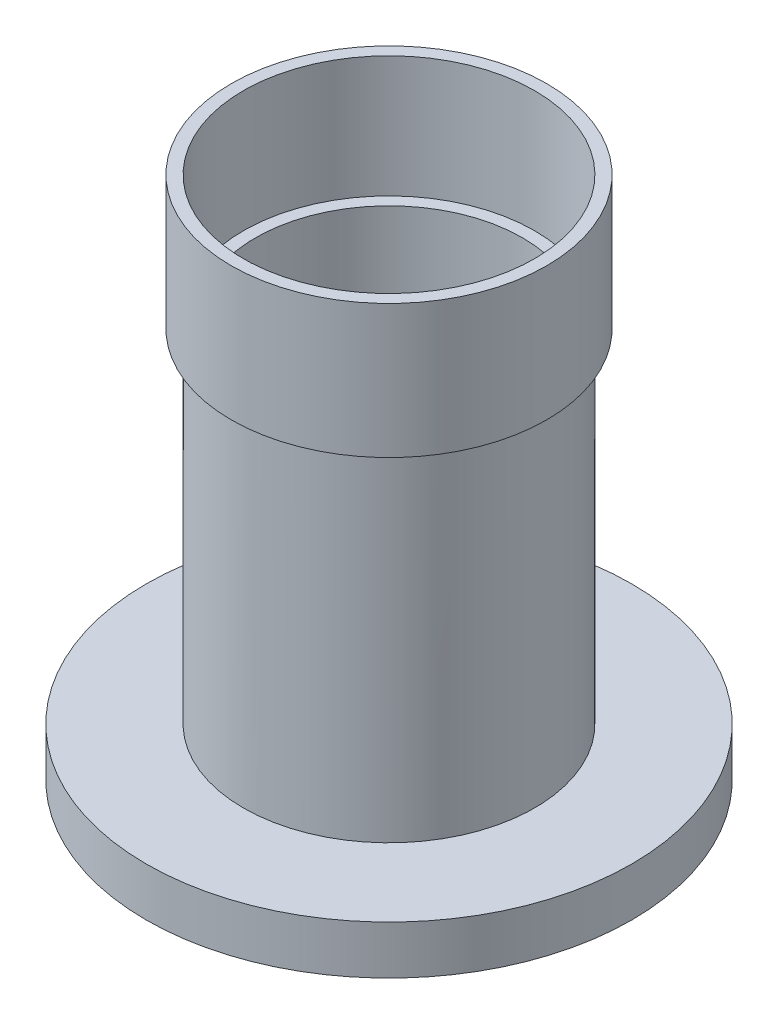
ISO-10303-21;
HEADER;
FILE_DESCRIPTION(('STEP AP214'),'2;1');
FILE_NAME('part.step','',(''),(''),'','','');
FILE_SCHEMA(('AUTOMOTIVE_DESIGN { 1 0 10303 214 1 1 1 1 }'));
ENDSEC;
DATA;
#1=APPLICATION_CONTEXT('core data for automotive mechanical design processes');
#2=APPLICATION_PROTOCOL_DEFINITION('international standard','automotive_design',2000,#1);
#3=PRODUCT_CONTEXT('',#1,'mechanical');
#4=PRODUCT('Part','Part','',(#3));
#5=PRODUCT_RELATED_PRODUCT_CATEGORY('part','',(#4));
#6=PRODUCT_DEFINITION_FORMATION('','',#4);
#7=PRODUCT_DEFINITION_CONTEXT('part definition',#1,'design');
#8=PRODUCT_DEFINITION('design','',#6,#7);
#9=PRODUCT_DEFINITION_SHAPE('','',#8);
#10=(LENGTH_UNIT() NAMED_UNIT(*) SI_UNIT(.MILLI.,.METRE.));
#11=(NAMED_UNIT(*) PLANE_ANGLE_UNIT() SI_UNIT($,.RADIAN.));
#12=(NAMED_UNIT(*) SI_UNIT($,.STERADIAN.) SOLID_ANGLE_UNIT());
#13=UNCERTAINTY_MEASURE_WITH_UNIT(LENGTH_MEASURE(1.E-05),#10,'distance_accuracy_value','');
#14=(GEOMETRIC_REPRESENTATION_CONTEXT(3) GLOBAL_UNCERTAINTY_ASSIGNED_CONTEXT((#13)) GLOBAL_UNIT_ASSIGNED_CONTEXT((#10,
#11,#12)) REPRESENTATION_CONTEXT('',''));
#15=CARTESIAN_POINT('',(0.,0.,0.));
#16=DIRECTION('',(0.,0.,1.));
#17=DIRECTION('',(1.,0.,0.));
#18=AXIS2_PLACEMENT_3D('',#15,#16,#17);
#19=CARTESIAN_POINT('',(0.,6.35,0.));
#20=DIRECTION('',(0.,-1.,0.));
#21=DIRECTION('',(0.,0.,-1.));
#22=AXIS2_PLACEMENT_3D('',#19,#20,#21);
#23=CYLINDRICAL_SURFACE('',#22,31.75);
#24=CARTESIAN_POINT('',(0.,6.35,0.));
#25=DIRECTION('',(0.,1.,0.));
#26=DIRECTION('',(0.,0.,1.));
#27=AXIS2_PLACEMENT_3D('',#24,#25,#26);
#28=CIRCLE('',#27,31.75);
#29=CARTESIAN_POINT('',(0.,6.35,31.75));
#30=VERTEX_POINT('',#29);
#31=EDGE_CURVE('E49',#30,#30,#28,.T.);
#32=ORIENTED_EDGE('',*,*,#31,.F.);
#33=EDGE_LOOP('',(#32));
#34=FACE_BOUND('',#33,.T.);
#35=CARTESIAN_POINT('',(0.,0.,0.));
#36=DIRECTION('',(0.,1.,0.));
#37=DIRECTION('',(0.,0.,1.));
#38=AXIS2_PLACEMENT_3D('',#35,#36,#37);
#39=CIRCLE('',#38,31.75);
#40=CARTESIAN_POINT('',(0.,0.,31.75));
#41=VERTEX_POINT('',#40);
#42=EDGE_CURVE('E54',#41,#41,#39,.T.);
#43=ORIENTED_EDGE('',*,*,#42,.T.);
#44=EDGE_LOOP('',(#43));
#45=FACE_BOUND('',#44,.T.);
#46=ADVANCED_FACE('F37',(#34,#45),#23,.T.);
#47=CARTESIAN_POINT('',(0.,6.35,0.));
#48=DIRECTION('',(0.,1.,0.));
#49=DIRECTION('',(0.,0.,1.));
#50=AXIS2_PLACEMENT_3D('',#47,#48,#49);
#51=PLANE('',#50);
#52=CARTESIAN_POINT('',(0.,6.35,0.));
#53=DIRECTION('',(0.,1.,0.));
#54=DIRECTION('',(0.,0.,1.));
#55=AXIS2_PLACEMENT_3D('',#52,#53,#54);
#56=CIRCLE('',#55,19.05);
#57=CARTESIAN_POINT('',(0.,6.35,19.05));
#58=VERTEX_POINT('',#57);
#59=EDGE_CURVE('E44',#58,#58,#56,.T.);
#60=ORIENTED_EDGE('',*,*,#59,.F.);
#61=EDGE_LOOP('',(#60));
#62=FACE_BOUND('',#61,.T.);
#63=ORIENTED_EDGE('',*,*,#31,.T.);
#64=EDGE_LOOP('',(#63));
#65=FACE_BOUND('',#64,.T.);
#66=ADVANCED_FACE('F100',(#62,#65),#51,.T.);
#67=CARTESIAN_POINT('',(0.,0.,0.));
#68=DIRECTION('',(0.,1.,0.));
#69=DIRECTION('',(0.,0.,1.));
#70=AXIS2_PLACEMENT_3D('',#67,#68,#69);
#71=PLANE('',#70);
#72=ORIENTED_EDGE('',*,*,#42,.F.);
#73=EDGE_LOOP('',(#72));
#74=FACE_BOUND('',#73,.T.);
#75=ADVANCED_FACE('F90',(#74),#71,.F.);
#76=CARTESIAN_POINT('',(19.05,51.1175,0.));
#77=DIRECTION('',(0.,-1.,0.));
#78=DIRECTION('',(0.,0.,-1.));
#79=AXIS2_PLACEMENT_3D('',#76,#77,#78);
#80=PLANE('',#79);
#81=CARTESIAN_POINT('',(0.,51.1175,0.));
#82=DIRECTION('',(0.,-1.,0.));
#83=DIRECTION('',(0.,0.,-1.));
#84=AXIS2_PLACEMENT_3D('',#81,#82,#83);
#85=CIRCLE('',#84,20.6375);
#86=CARTESIAN_POINT('',(0.,51.1175,-20.6375));
#87=VERTEX_POINT('',#86);
#88=EDGE_CURVE('E59',#87,#87,#85,.T.);
#89=ORIENTED_EDGE('',*,*,#88,.T.);
#90=EDGE_LOOP('',(#89));
#91=FACE_BOUND('',#90,.T.);
#92=CARTESIAN_POINT('',(0.,51.1175,0.));
#93=DIRECTION('',(0.,-1.,0.));
#94=DIRECTION('',(0.,0.,-1.));
#95=AXIS2_PLACEMENT_3D('',#92,#93,#94);
#96=CIRCLE('',#95,19.05);
#97=CARTESIAN_POINT('',(0.,51.1175,-19.05));
#98=VERTEX_POINT('',#97);
#99=EDGE_CURVE('E80',#98,#98,#96,.T.);
#100=ORIENTED_EDGE('',*,*,#99,.F.);
#101=EDGE_LOOP('',(#100));
#102=FACE_BOUND('',#101,.T.);
#103=ADVANCED_FACE('F87',(#91,#102),#80,.T.);
#104=CARTESIAN_POINT('',(0.,-26.0674728269333,0.));
#105=DIRECTION('',(0.,-1.,0.));
#106=DIRECTION('',(0.,0.,-1.));
#107=AXIS2_PLACEMENT_3D('',#104,#105,#106);
#108=CYLINDRICAL_SURFACE('',#107,20.6375);
#109=CARTESIAN_POINT('',(0.,68.58,0.));
#110=DIRECTION('',(0.,-1.,0.));
#111=DIRECTION('',(0.,0.,-1.));
#112=AXIS2_PLACEMENT_3D('',#109,#110,#111);
#113=CIRCLE('',#112,20.6375);
#114=CARTESIAN_POINT('',(0.,68.58,-20.6375));
#115=VERTEX_POINT('',#114);
#116=EDGE_CURVE('E64',#115,#115,#113,.T.);
#117=ORIENTED_EDGE('',*,*,#116,.T.);
#118=EDGE_LOOP('',(#117));
#119=FACE_BOUND('',#118,.T.);
#120=ORIENTED_EDGE('',*,*,#88,.F.);
#121=EDGE_LOOP('',(#120));
#122=FACE_BOUND('',#121,.T.);
#123=ADVANCED_FACE('F89',(#119,#122),#108,.T.);
#124=CARTESIAN_POINT('',(20.6375,68.58,0.));
#125=DIRECTION('',(0.,1.,0.));
#126=DIRECTION('',(0.,0.,1.));
#127=AXIS2_PLACEMENT_3D('',#124,#125,#126);
#128=PLANE('',#127);
#129=CARTESIAN_POINT('',(0.,68.58,0.));
#130=DIRECTION('',(0.,-1.,0.));
#131=DIRECTION('',(0.,0.,-1.));
#132=AXIS2_PLACEMENT_3D('',#129,#130,#131);
#133=CIRCLE('',#132,19.05);
#134=CARTESIAN_POINT('',(0.,68.58,-19.05));
#135=VERTEX_POINT('',#134);
#136=EDGE_CURVE('E68',#135,#135,#133,.T.);
#137=ORIENTED_EDGE('',*,*,#136,.T.);
#138=EDGE_LOOP('',(#137));
#139=FACE_BOUND('',#138,.T.);
#140=ORIENTED_EDGE('',*,*,#116,.F.);
#141=EDGE_LOOP('',(#140));
#142=FACE_BOUND('',#141,.T.);
#143=ADVANCED_FACE('F97',(#139,#142),#128,.T.);
#144=CARTESIAN_POINT('',(0.,-26.0674728269333,0.));
#145=DIRECTION('',(0.,-1.,0.));
#146=DIRECTION('',(0.,0.,-1.));
#147=AXIS2_PLACEMENT_3D('',#144,#145,#146);
#148=CYLINDRICAL_SURFACE('',#147,19.05);
#149=CARTESIAN_POINT('',(0.,52.705,0.));
#150=DIRECTION('',(0.,-1.,0.));
#151=DIRECTION('',(0.,0.,-1.));
#152=AXIS2_PLACEMENT_3D('',#149,#150,#151);
#153=CIRCLE('',#152,19.05);
#154=CARTESIAN_POINT('',(0.,52.705,-19.05));
#155=VERTEX_POINT('',#154);
#156=EDGE_CURVE('E72',#155,#155,#153,.T.);
#157=ORIENTED_EDGE('',*,*,#156,.T.);
#158=EDGE_LOOP('',(#157));
#159=FACE_BOUND('',#158,.T.);
#160=ORIENTED_EDGE('',*,*,#136,.F.);
#161=EDGE_LOOP('',(#160));
#162=FACE_BOUND('',#161,.T.);
#163=ADVANCED_FACE('F131',(#159,#162),#148,.F.);
#164=CARTESIAN_POINT('',(19.05,52.705,0.));
#165=DIRECTION('',(0.,1.,0.));
#166=DIRECTION('',(0.,0.,1.));
#167=AXIS2_PLACEMENT_3D('',#164,#165,#166);
#168=PLANE('',#167);
#169=CARTESIAN_POINT('',(0.,52.705,0.));
#170=DIRECTION('',(0.,-1.,0.));
#171=DIRECTION('',(0.,0.,-1.));
#172=AXIS2_PLACEMENT_3D('',#169,#170,#171);
#173=CIRCLE('',#172,17.4625);
#174=CARTESIAN_POINT('',(0.,52.705,-17.4625));
#175=VERTEX_POINT('',#174);
#176=EDGE_CURVE('E76',#175,#175,#173,.T.);
#177=ORIENTED_EDGE('',*,*,#176,.T.);
#178=EDGE_LOOP('',(#177));
#179=FACE_BOUND('',#178,.T.);
#180=ORIENTED_EDGE('',*,*,#156,.F.);
#181=EDGE_LOOP('',(#180));
#182=FACE_BOUND('',#181,.T.);
#183=ADVANCED_FACE('F126',(#179,#182),#168,.T.);
#184=CARTESIAN_POINT('',(0.,-26.0674728269333,0.));
#185=DIRECTION('',(0.,-1.,0.));
#186=DIRECTION('',(0.,0.,-1.));
#187=AXIS2_PLACEMENT_3D('',#184,#185,#186);
#188=CYLINDRICAL_SURFACE('',#187,17.4625);
#189=CARTESIAN_POINT('',(0.,6.35,0.));
#190=DIRECTION('',(0.,1.,0.));
#191=DIRECTION('',(0.,0.,1.));
#192=AXIS2_PLACEMENT_3D('',#189,#190,#191);
#193=CIRCLE('',#192,17.4625);
#194=CARTESIAN_POINT('',(0.,6.35,17.4625));
#195=VERTEX_POINT('',#194);
#196=EDGE_CURVE('E10',#195,#195,#193,.F.);
#197=ORIENTED_EDGE('',*,*,#196,.T.);
#198=EDGE_LOOP('',(#197));
#199=FACE_BOUND('',#198,.T.);
#200=ORIENTED_EDGE('',*,*,#176,.F.);
#201=EDGE_LOOP('',(#200));
#202=FACE_BOUND('',#201,.T.);
#203=ADVANCED_FACE('F121',(#199,#202),#188,.F.);
#204=CARTESIAN_POINT('',(0.,-26.0674728269333,0.));
#205=DIRECTION('',(0.,-1.,0.));
#206=DIRECTION('',(0.,0.,-1.));
#207=AXIS2_PLACEMENT_3D('',#204,#205,#206);
#208=CYLINDRICAL_SURFACE('',#207,19.05);
#209=ORIENTED_EDGE('',*,*,#99,.T.);
#210=EDGE_LOOP('',(#209));
#211=FACE_BOUND('',#210,.T.);
#212=ORIENTED_EDGE('',*,*,#59,.T.);
#213=EDGE_LOOP('',(#212));
#214=FACE_BOUND('',#213,.T.);
#215=ADVANCED_FACE('F85',(#211,#214),#208,.T.);
#216=ORIENTED_EDGE('',*,*,#196,.F.);
#217=EDGE_LOOP('',(#216));
#218=FACE_BOUND('',#217,.T.);
#219=ADVANCED_FACE('F109',(#218),#51,.T.);
#220=CLOSED_SHELL('',(#46,#66,#75,#103,#123,#143,#163,#183,#203,#215,#219));
#221=MANIFOLD_SOLID_BREP('B2',#220);
#222=ADVANCED_BREP_SHAPE_REPRESENTATION('',(#18,#221),#14);
#223=SHAPE_DEFINITION_REPRESENTATION(#9,#222);
ENDSEC;
END-ISO-10303-21;
